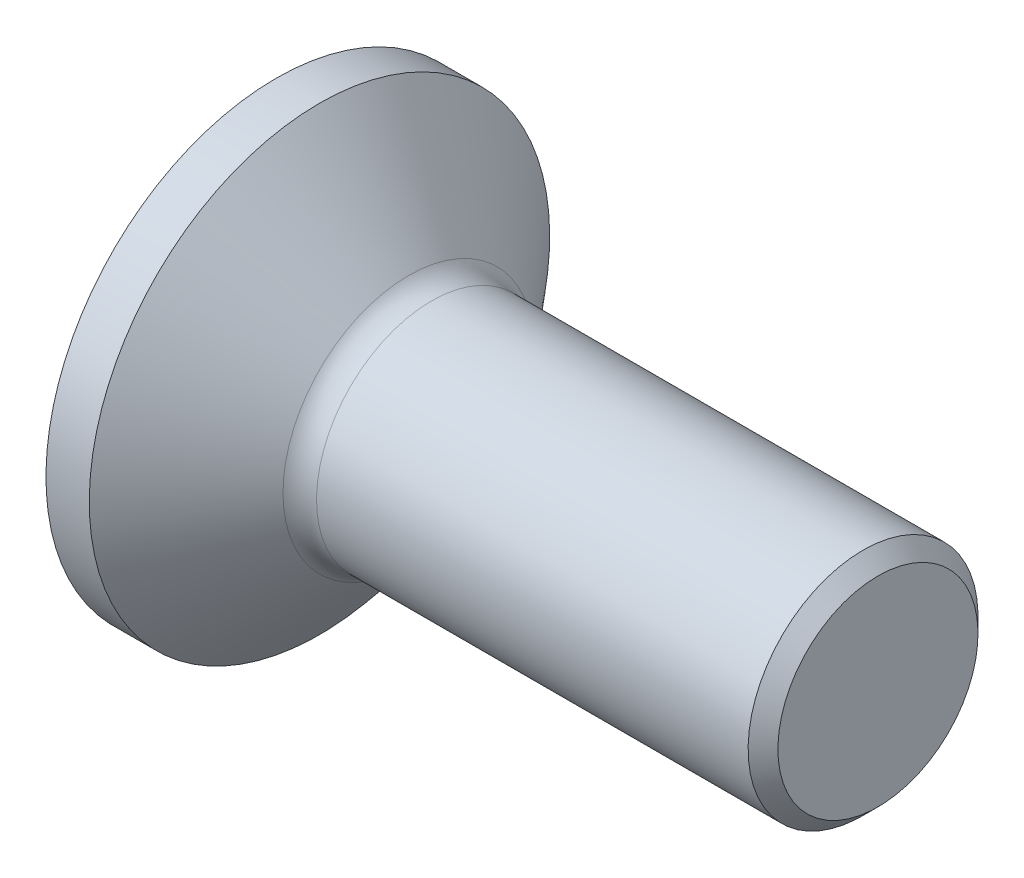
ISO-10303-21;
HEADER;
FILE_DESCRIPTION(('STEP AP214'),'2;1');
FILE_NAME('part.step','',(''),(''),'','','');
FILE_SCHEMA(('AUTOMOTIVE_DESIGN { 1 0 10303 214 1 1 1 1 }'));
ENDSEC;
DATA;
#1=APPLICATION_CONTEXT('core data for automotive mechanical design processes');
#2=APPLICATION_PROTOCOL_DEFINITION('international standard','automotive_design',2000,#1);
#3=PRODUCT_CONTEXT('',#1,'mechanical');
#4=PRODUCT('Part','Part','',(#3));
#5=PRODUCT_RELATED_PRODUCT_CATEGORY('part','',(#4));
#6=PRODUCT_DEFINITION_FORMATION('','',#4);
#7=PRODUCT_DEFINITION_CONTEXT('part definition',#1,'design');
#8=PRODUCT_DEFINITION('design','',#6,#7);
#9=PRODUCT_DEFINITION_SHAPE('','',#8);
#10=(LENGTH_UNIT() NAMED_UNIT(*) SI_UNIT(.MILLI.,.METRE.));
#11=(NAMED_UNIT(*) PLANE_ANGLE_UNIT() SI_UNIT($,.RADIAN.));
#12=(NAMED_UNIT(*) SI_UNIT($,.STERADIAN.) SOLID_ANGLE_UNIT());
#13=UNCERTAINTY_MEASURE_WITH_UNIT(LENGTH_MEASURE(1.E-05),#10,'distance_accuracy_value','');
#14=(GEOMETRIC_REPRESENTATION_CONTEXT(3) GLOBAL_UNCERTAINTY_ASSIGNED_CONTEXT((#13)) GLOBAL_UNIT_ASSIGNED_CONTEXT((#10,
#11,#12)) REPRESENTATION_CONTEXT('',''));
#15=CARTESIAN_POINT('',(0.,0.,0.));
#16=DIRECTION('',(0.,0.,1.));
#17=DIRECTION('',(1.,0.,0.));
#18=AXIS2_PLACEMENT_3D('',#15,#16,#17);
#19=CARTESIAN_POINT('',(2.58077461814255,0.,0.));
#20=DIRECTION('',(1.,0.,0.));
#21=DIRECTION('',(0.,1.,0.));
#22=AXIS2_PLACEMENT_3D('',#19,#20,#21);
#23=TOROIDAL_SURFACE('',#22,2.41,0.5);
#24=CARTESIAN_POINT('',(2.2,0.,0.));
#25=DIRECTION('',(1.,0.,0.));
#26=DIRECTION('',(0.,1.,0.));
#27=AXIS2_PLACEMENT_3D('',#24,#25,#26);
#28=CIRCLE('',#27,2.08594647019606);
#29=CARTESIAN_POINT('',(2.2,2.08594647019606,0.));
#30=VERTEX_POINT('',#29);
#31=EDGE_CURVE('E134',#30,#30,#28,.T.);
#32=ORIENTED_EDGE('',*,*,#31,.T.);
#33=EDGE_LOOP('',(#32));
#34=FACE_BOUND('',#33,.T.);
#35=CARTESIAN_POINT('',(2.58077461814255,0.,0.));
#36=DIRECTION('',(1.,0.,0.));
#37=DIRECTION('',(0.,1.,0.));
#38=AXIS2_PLACEMENT_3D('',#35,#36,#37);
#39=CIRCLE('',#38,1.91);
#40=CARTESIAN_POINT('',(2.58077461814255,1.91,0.));
#41=VERTEX_POINT('',#40);
#42=EDGE_CURVE('E11',#41,#41,#39,.T.);
#43=ORIENTED_EDGE('',*,*,#42,.F.);
#44=EDGE_LOOP('',(#43));
#45=FACE_BOUND('',#44,.T.);
#46=ADVANCED_FACE('F33',(#34,#45),#23,.F.);
#47=CARTESIAN_POINT('',(0.,0.,0.));
#48=DIRECTION('',(1.,0.,0.));
#49=DIRECTION('',(0.,1.,0.));
#50=AXIS2_PLACEMENT_3D('',#47,#48,#49);
#51=CYLINDRICAL_SURFACE('',#50,1.91);
#52=ORIENTED_EDGE('',*,*,#42,.T.);
#53=EDGE_LOOP('',(#52));
#54=FACE_BOUND('',#53,.T.);
#55=CARTESIAN_POINT('',(9.75251262658471,0.,0.));
#56=DIRECTION('',(1.,0.,0.));
#57=DIRECTION('',(0.,1.,0.));
#58=AXIS2_PLACEMENT_3D('',#55,#56,#57);
#59=CIRCLE('',#58,1.91);
#60=CARTESIAN_POINT('',(9.75251262658471,1.91,0.));
#61=VERTEX_POINT('',#60);
#62=EDGE_CURVE('E40',#61,#61,#59,.T.);
#63=ORIENTED_EDGE('',*,*,#62,.F.);
#64=EDGE_LOOP('',(#63));
#65=FACE_BOUND('',#64,.T.);
#66=ADVANCED_FACE('F156',(#54,#65),#51,.T.);
#67=CARTESIAN_POINT('',(10.,0.,0.));
#68=DIRECTION('',(-1.,0.,0.));
#69=DIRECTION('',(0.,-1.,0.));
#70=AXIS2_PLACEMENT_3D('',#67,#68,#69);
#71=CONICAL_SURFACE('',#70,1.66251262658471,0.78539816339745);
#72=ORIENTED_EDGE('',*,*,#62,.T.);
#73=EDGE_LOOP('',(#72));
#74=FACE_BOUND('',#73,.T.);
#75=CARTESIAN_POINT('',(10.,0.,0.));
#76=DIRECTION('',(1.,0.,0.));
#77=DIRECTION('',(0.,1.,0.));
#78=AXIS2_PLACEMENT_3D('',#75,#76,#77);
#79=CIRCLE('',#78,1.66251262658471);
#80=CARTESIAN_POINT('',(10.,1.66251262658471,0.));
#81=VERTEX_POINT('',#80);
#82=EDGE_CURVE('E148',#81,#81,#79,.T.);
#83=ORIENTED_EDGE('',*,*,#82,.F.);
#84=EDGE_LOOP('',(#83));
#85=FACE_BOUND('',#84,.T.);
#86=ADVANCED_FACE('F153',(#74,#85),#71,.T.);
#87=CARTESIAN_POINT('',(10.,1.66251262658471,0.));
#88=DIRECTION('',(1.,0.,0.));
#89=DIRECTION('',(0.,1.,0.));
#90=AXIS2_PLACEMENT_3D('',#87,#88,#89);
#91=PLANE('',#90);
#92=ORIENTED_EDGE('',*,*,#82,.T.);
#93=EDGE_LOOP('',(#92));
#94=FACE_BOUND('',#93,.T.);
#95=ADVANCED_FACE('F163',(#94),#91,.T.);
#96=CARTESIAN_POINT('',(0.,3.825,0.));
#97=DIRECTION('',(-1.,0.,0.));
#98=DIRECTION('',(0.,-1.,0.));
#99=AXIS2_PLACEMENT_3D('',#96,#97,#98);
#100=PLANE('',#99);
#101=DIRECTION('',(0.,1.,0.));
#102=VECTOR('',#101,1.);
#103=CARTESIAN_POINT('',(0.,-0.721687836487033,1.25));
#104=LINE('',#103,#102);
#105=CARTESIAN_POINT('',(0.,-0.721687836487033,1.25));
#106=VERTEX_POINT('',#105);
#107=CARTESIAN_POINT('',(0.,0.721687836487032,1.25));
#108=VERTEX_POINT('',#107);
#109=EDGE_CURVE('E47',#106,#108,#104,.T.);
#110=ORIENTED_EDGE('',*,*,#109,.F.);
#111=DIRECTION('',(0.,0.5,0.866025403784439));
#112=VECTOR('',#111,1.);
#113=CARTESIAN_POINT('',(0.,-1.44337567297406,0.));
#114=LINE('',#113,#112);
#115=CARTESIAN_POINT('',(0.,-1.44337567297406,0.));
#116=VERTEX_POINT('',#115);
#117=EDGE_CURVE('E130',#116,#106,#114,.T.);
#118=ORIENTED_EDGE('',*,*,#117,.F.);
#119=DIRECTION('',(0.,-0.5,0.866025403784439));
#120=VECTOR('',#119,1.);
#121=CARTESIAN_POINT('',(0.,-0.721687836487032,-1.25));
#122=LINE('',#121,#120);
#123=CARTESIAN_POINT('',(0.,-0.721687836487032,-1.25));
#124=VERTEX_POINT('',#123);
#125=EDGE_CURVE('E128',#124,#116,#122,.T.);
#126=ORIENTED_EDGE('',*,*,#125,.F.);
#127=DIRECTION('',(0.,-1.,0.));
#128=VECTOR('',#127,1.);
#129=CARTESIAN_POINT('',(0.,0.721687836487032,-1.25));
#130=LINE('',#129,#128);
#131=CARTESIAN_POINT('',(0.,0.721687836487032,-1.25));
#132=VERTEX_POINT('',#131);
#133=EDGE_CURVE('E95',#132,#124,#130,.T.);
#134=ORIENTED_EDGE('',*,*,#133,.F.);
#135=DIRECTION('',(0.,-0.5,-0.866025403784439));
#136=VECTOR('',#135,1.);
#137=CARTESIAN_POINT('',(0.,1.44337567297406,0.));
#138=LINE('',#137,#136);
#139=CARTESIAN_POINT('',(0.,1.44337567297406,0.));
#140=VERTEX_POINT('',#139);
#141=EDGE_CURVE('E124',#140,#132,#138,.T.);
#142=ORIENTED_EDGE('',*,*,#141,.F.);
#143=DIRECTION('',(0.,0.5,-0.866025403784439));
#144=VECTOR('',#143,1.);
#145=CARTESIAN_POINT('',(0.,0.721687836487032,1.25));
#146=LINE('',#145,#144);
#147=EDGE_CURVE('E121',#108,#140,#146,.T.);
#148=ORIENTED_EDGE('',*,*,#147,.F.);
#149=EDGE_LOOP('',(#110,#118,#126,#134,#142,#148));
#150=FACE_BOUND('',#149,.T.);
#151=CARTESIAN_POINT('',(0.,0.,0.));
#152=DIRECTION('',(1.,0.,0.));
#153=DIRECTION('',(0.,1.,0.));
#154=AXIS2_PLACEMENT_3D('',#151,#152,#153);
#155=CIRCLE('',#154,3.825);
#156=CARTESIAN_POINT('',(0.,3.825,0.));
#157=VERTEX_POINT('',#156);
#158=EDGE_CURVE('E145',#157,#157,#155,.T.);
#159=ORIENTED_EDGE('',*,*,#158,.F.);
#160=EDGE_LOOP('',(#159));
#161=FACE_BOUND('',#160,.T.);
#162=ADVANCED_FACE('F169',(#150,#161),#100,.T.);
#163=CARTESIAN_POINT('',(0.,0.,0.));
#164=DIRECTION('',(1.,0.,0.));
#165=DIRECTION('',(0.,1.,0.));
#166=AXIS2_PLACEMENT_3D('',#163,#164,#165);
#167=CYLINDRICAL_SURFACE('',#166,3.825);
#168=ORIENTED_EDGE('',*,*,#158,.T.);
#169=EDGE_LOOP('',(#168));
#170=FACE_BOUND('',#169,.T.);
#171=CARTESIAN_POINT('',(0.72,0.,0.));
#172=DIRECTION('',(1.,0.,0.));
#173=DIRECTION('',(0.,1.,0.));
#174=AXIS2_PLACEMENT_3D('',#171,#172,#173);
#175=CIRCLE('',#174,3.825);
#176=CARTESIAN_POINT('',(0.72,3.825,0.));
#177=VERTEX_POINT('',#176);
#178=EDGE_CURVE('E142',#177,#177,#175,.T.);
#179=ORIENTED_EDGE('',*,*,#178,.F.);
#180=EDGE_LOOP('',(#179));
#181=FACE_BOUND('',#180,.T.);
#182=ADVANCED_FACE('F173',(#170,#181),#167,.T.);
#183=CARTESIAN_POINT('',(2.2,0.,0.));
#184=DIRECTION('',(-1.,0.,0.));
#185=DIRECTION('',(0.,-1.,0.));
#186=AXIS2_PLACEMENT_3D('',#183,#184,#185);
#187=CONICAL_SURFACE('',#186,2.08594647019606,0.86570017138859);
#188=ORIENTED_EDGE('',*,*,#178,.T.);
#189=EDGE_LOOP('',(#188));
#190=FACE_BOUND('',#189,.T.);
#191=ORIENTED_EDGE('',*,*,#31,.F.);
#192=EDGE_LOOP('',(#191));
#193=FACE_BOUND('',#192,.T.);
#194=ADVANCED_FACE('F177',(#190,#193),#187,.T.);
#195=CARTESIAN_POINT('',(1.5,-0.721687836487033,1.25));
#196=DIRECTION('',(0.,0.,1.));
#197=DIRECTION('',(0.,-1.,0.));
#198=AXIS2_PLACEMENT_3D('',#195,#196,#197);
#199=PLANE('',#198);
#200=ORIENTED_EDGE('',*,*,#109,.T.);
#201=DIRECTION('',(-1.,0.,0.));
#202=VECTOR('',#201,1.);
#203=CARTESIAN_POINT('',(1.5,0.721687836487032,1.25));
#204=LINE('',#203,#202);
#205=CARTESIAN_POINT('',(1.5,0.721687836487032,1.25));
#206=VERTEX_POINT('',#205);
#207=EDGE_CURVE('E77',#206,#108,#204,.T.);
#208=ORIENTED_EDGE('',*,*,#207,.F.);
#209=DIRECTION('',(0.,1.,0.));
#210=VECTOR('',#209,1.);
#211=CARTESIAN_POINT('',(1.5,-0.721687836487033,1.25));
#212=LINE('',#211,#210);
#213=CARTESIAN_POINT('',(1.5,-0.721687836487033,1.25));
#214=VERTEX_POINT('',#213);
#215=EDGE_CURVE('E132',#214,#206,#212,.T.);
#216=ORIENTED_EDGE('',*,*,#215,.F.);
#217=DIRECTION('',(-1.,0.,0.));
#218=VECTOR('',#217,1.);
#219=CARTESIAN_POINT('',(1.5,-0.721687836487033,1.25));
#220=LINE('',#219,#218);
#221=EDGE_CURVE('E55',#214,#106,#220,.T.);
#222=ORIENTED_EDGE('',*,*,#221,.T.);
#223=EDGE_LOOP('',(#200,#208,#216,#222));
#224=FACE_BOUND('',#223,.T.);
#225=ADVANCED_FACE('F181',(#224),#199,.F.);
#226=CARTESIAN_POINT('',(1.5,-1.44337567297406,0.));
#227=DIRECTION('',(0.,-0.866025403784439,0.5));
#228=DIRECTION('',(0.,-0.5,-0.866025403784439));
#229=AXIS2_PLACEMENT_3D('',#226,#227,#228);
#230=PLANE('',#229);
#231=ORIENTED_EDGE('',*,*,#117,.T.);
#232=ORIENTED_EDGE('',*,*,#221,.F.);
#233=DIRECTION('',(0.,0.5,0.866025403784439));
#234=VECTOR('',#233,1.);
#235=CARTESIAN_POINT('',(1.5,-1.44337567297406,0.));
#236=LINE('',#235,#234);
#237=CARTESIAN_POINT('',(1.5,-1.44337567297406,0.));
#238=VERTEX_POINT('',#237);
#239=EDGE_CURVE('E107',#238,#214,#236,.T.);
#240=ORIENTED_EDGE('',*,*,#239,.F.);
#241=DIRECTION('',(-1.,0.,0.));
#242=VECTOR('',#241,1.);
#243=CARTESIAN_POINT('',(1.5,-1.44337567297406,0.));
#244=LINE('',#243,#242);
#245=EDGE_CURVE('E99',#238,#116,#244,.T.);
#246=ORIENTED_EDGE('',*,*,#245,.T.);
#247=EDGE_LOOP('',(#231,#232,#240,#246));
#248=FACE_BOUND('',#247,.T.);
#249=ADVANCED_FACE('F185',(#248),#230,.F.);
#250=CARTESIAN_POINT('',(1.5,-0.721687836487032,-1.25));
#251=DIRECTION('',(0.,-0.866025403784439,-0.5));
#252=DIRECTION('',(0.,0.5,-0.866025403784439));
#253=AXIS2_PLACEMENT_3D('',#250,#251,#252);
#254=PLANE('',#253);
#255=ORIENTED_EDGE('',*,*,#125,.T.);
#256=ORIENTED_EDGE('',*,*,#245,.F.);
#257=DIRECTION('',(0.,-0.5,0.866025403784439));
#258=VECTOR('',#257,1.);
#259=CARTESIAN_POINT('',(1.5,-0.721687836487032,-1.25));
#260=LINE('',#259,#258);
#261=CARTESIAN_POINT('',(1.5,-0.721687836487032,-1.25));
#262=VERTEX_POINT('',#261);
#263=EDGE_CURVE('E103',#262,#238,#260,.T.);
#264=ORIENTED_EDGE('',*,*,#263,.F.);
#265=DIRECTION('',(-1.,0.,0.));
#266=VECTOR('',#265,1.);
#267=CARTESIAN_POINT('',(1.5,-0.721687836487032,-1.25));
#268=LINE('',#267,#266);
#269=EDGE_CURVE('E88',#262,#124,#268,.T.);
#270=ORIENTED_EDGE('',*,*,#269,.T.);
#271=EDGE_LOOP('',(#255,#256,#264,#270));
#272=FACE_BOUND('',#271,.T.);
#273=ADVANCED_FACE('F104',(#272),#254,.F.);
#274=CARTESIAN_POINT('',(1.5,0.721687836487032,-1.25));
#275=DIRECTION('',(0.,0.,-1.));
#276=DIRECTION('',(-1.,0.,0.));
#277=AXIS2_PLACEMENT_3D('',#274,#275,#276);
#278=PLANE('',#277);
#279=ORIENTED_EDGE('',*,*,#133,.T.);
#280=ORIENTED_EDGE('',*,*,#269,.F.);
#281=DIRECTION('',(0.,-1.,0.));
#282=VECTOR('',#281,1.);
#283=CARTESIAN_POINT('',(1.5,0.721687836487032,-1.25));
#284=LINE('',#283,#282);
#285=CARTESIAN_POINT('',(1.5,0.721687836487032,-1.25));
#286=VERTEX_POINT('',#285);
#287=EDGE_CURVE('E92',#286,#262,#284,.T.);
#288=ORIENTED_EDGE('',*,*,#287,.F.);
#289=DIRECTION('',(-1.,0.,0.));
#290=VECTOR('',#289,1.);
#291=CARTESIAN_POINT('',(1.5,0.721687836487032,-1.25));
#292=LINE('',#291,#290);
#293=EDGE_CURVE('E100',#286,#132,#292,.T.);
#294=ORIENTED_EDGE('',*,*,#293,.T.);
#295=EDGE_LOOP('',(#279,#280,#288,#294));
#296=FACE_BOUND('',#295,.T.);
#297=ADVANCED_FACE('F90',(#296),#278,.F.);
#298=CARTESIAN_POINT('',(1.5,1.44337567297406,0.));
#299=DIRECTION('',(0.,0.866025403784439,-0.5));
#300=DIRECTION('',(0.,0.5,0.866025403784439));
#301=AXIS2_PLACEMENT_3D('',#298,#299,#300);
#302=PLANE('',#301);
#303=ORIENTED_EDGE('',*,*,#141,.T.);
#304=ORIENTED_EDGE('',*,*,#293,.F.);
#305=DIRECTION('',(0.,-0.5,-0.866025403784439));
#306=VECTOR('',#305,1.);
#307=CARTESIAN_POINT('',(1.5,1.44337567297406,0.));
#308=LINE('',#307,#306);
#309=CARTESIAN_POINT('',(1.5,1.44337567297406,0.));
#310=VERTEX_POINT('',#309);
#311=EDGE_CURVE('E113',#310,#286,#308,.T.);
#312=ORIENTED_EDGE('',*,*,#311,.F.);
#313=DIRECTION('',(-1.,0.,0.));
#314=VECTOR('',#313,1.);
#315=CARTESIAN_POINT('',(1.5,1.44337567297406,0.));
#316=LINE('',#315,#314);
#317=EDGE_CURVE('E137',#310,#140,#316,.T.);
#318=ORIENTED_EDGE('',*,*,#317,.T.);
#319=EDGE_LOOP('',(#303,#304,#312,#318));
#320=FACE_BOUND('',#319,.T.);
#321=ADVANCED_FACE('F189',(#320),#302,.F.);
#322=CARTESIAN_POINT('',(1.5,0.721687836487032,1.25));
#323=DIRECTION('',(0.,0.866025403784439,0.5));
#324=DIRECTION('',(0.,-0.5,0.866025403784439));
#325=AXIS2_PLACEMENT_3D('',#322,#323,#324);
#326=PLANE('',#325);
#327=ORIENTED_EDGE('',*,*,#147,.T.);
#328=ORIENTED_EDGE('',*,*,#317,.F.);
#329=DIRECTION('',(0.,0.5,-0.866025403784439));
#330=VECTOR('',#329,1.);
#331=CARTESIAN_POINT('',(1.5,0.721687836487032,1.25));
#332=LINE('',#331,#330);
#333=EDGE_CURVE('E115',#206,#310,#332,.T.);
#334=ORIENTED_EDGE('',*,*,#333,.F.);
#335=ORIENTED_EDGE('',*,*,#207,.T.);
#336=EDGE_LOOP('',(#327,#328,#334,#335));
#337=FACE_BOUND('',#336,.T.);
#338=ADVANCED_FACE('F186',(#337),#326,.F.);
#339=CARTESIAN_POINT('',(1.5,0.,0.));
#340=DIRECTION('',(-1.,0.,0.));
#341=DIRECTION('',(0.,-1.,0.));
#342=AXIS2_PLACEMENT_3D('',#339,#340,#341);
#343=PLANE('',#342);
#344=ORIENTED_EDGE('',*,*,#215,.T.);
#345=ORIENTED_EDGE('',*,*,#333,.T.);
#346=ORIENTED_EDGE('',*,*,#311,.T.);
#347=ORIENTED_EDGE('',*,*,#287,.T.);
#348=ORIENTED_EDGE('',*,*,#263,.T.);
#349=ORIENTED_EDGE('',*,*,#239,.T.);
#350=EDGE_LOOP('',(#344,#345,#346,#347,#348,#349));
#351=FACE_BOUND('',#350,.T.);
#352=ADVANCED_FACE('F110',(#351),#343,.T.);
#353=CLOSED_SHELL('',(#46,#66,#86,#95,#162,#182,#194,#225,#249,#273,#297,#321,#338,#352));
#354=MANIFOLD_SOLID_BREP('B2',#353);
#355=ADVANCED_BREP_SHAPE_REPRESENTATION('',(#18,#354),#14);
#356=SHAPE_DEFINITION_REPRESENTATION(#9,#355);
ENDSEC;
END-ISO-10303-21;
